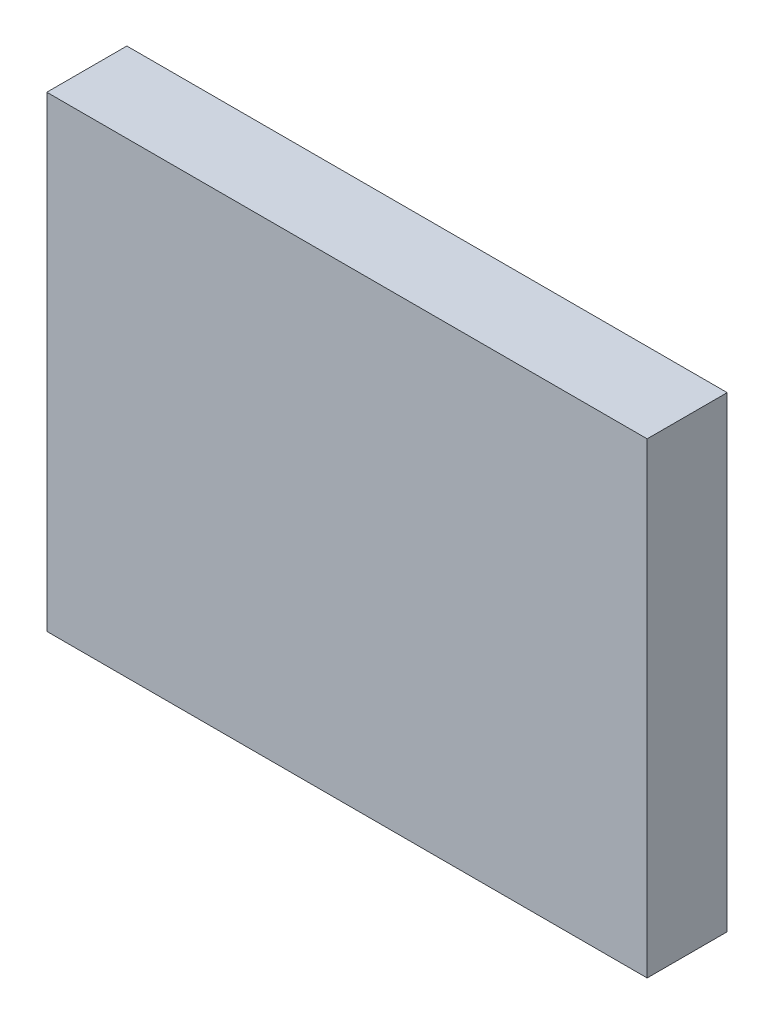
ISO-10303-21;
HEADER;
FILE_DESCRIPTION(('STEP AP214'),'2;1');
FILE_NAME('part.step','',(''),(''),'','','');
FILE_SCHEMA(('AUTOMOTIVE_DESIGN { 1 0 10303 214 1 1 1 1 }'));
ENDSEC;
DATA;
#1=APPLICATION_CONTEXT('core data for automotive mechanical design processes');
#2=APPLICATION_PROTOCOL_DEFINITION('international standard','automotive_design',2000,#1);
#3=PRODUCT_CONTEXT('',#1,'mechanical');
#4=PRODUCT('Part','Part','',(#3));
#5=PRODUCT_RELATED_PRODUCT_CATEGORY('part','',(#4));
#6=PRODUCT_DEFINITION_FORMATION('','',#4);
#7=PRODUCT_DEFINITION_CONTEXT('part definition',#1,'design');
#8=PRODUCT_DEFINITION('design','',#6,#7);
#9=PRODUCT_DEFINITION_SHAPE('','',#8);
#10=(LENGTH_UNIT() NAMED_UNIT(*) SI_UNIT(.MILLI.,.METRE.));
#11=(NAMED_UNIT(*) PLANE_ANGLE_UNIT() SI_UNIT($,.RADIAN.));
#12=(NAMED_UNIT(*) SI_UNIT($,.STERADIAN.) SOLID_ANGLE_UNIT());
#13=UNCERTAINTY_MEASURE_WITH_UNIT(LENGTH_MEASURE(1.E-05),#10,'distance_accuracy_value','');
#14=(GEOMETRIC_REPRESENTATION_CONTEXT(3) GLOBAL_UNCERTAINTY_ASSIGNED_CONTEXT((#13)) GLOBAL_UNIT_ASSIGNED_CONTEXT((#10,
#11,#12)) REPRESENTATION_CONTEXT('',''));
#15=CARTESIAN_POINT('',(0.,0.,0.));
#16=DIRECTION('',(0.,0.,1.));
#17=DIRECTION('',(1.,0.,0.));
#18=AXIS2_PLACEMENT_3D('',#15,#16,#17);
#19=CARTESIAN_POINT('',(4.5,-3.5,1.2));
#20=DIRECTION('',(-1.,0.,0.));
#21=DIRECTION('',(0.,0.,1.));
#22=AXIS2_PLACEMENT_3D('',#19,#20,#21);
#23=PLANE('',#22);
#24=DIRECTION('',(0.,1.,0.));
#25=VECTOR('',#24,1.);
#26=CARTESIAN_POINT('',(4.5,-3.5,0.));
#27=LINE('',#26,#25);
#28=CARTESIAN_POINT('',(4.5,-3.5,0.));
#29=VERTEX_POINT('',#28);
#30=CARTESIAN_POINT('',(4.5,3.5,0.));
#31=VERTEX_POINT('',#30);
#32=EDGE_CURVE('E11',#29,#31,#27,.T.);
#33=ORIENTED_EDGE('',*,*,#32,.T.);
#34=DIRECTION('',(0.,0.,-1.));
#35=VECTOR('',#34,1.);
#36=CARTESIAN_POINT('',(4.5,3.5,1.2));
#37=LINE('',#36,#35);
#38=CARTESIAN_POINT('',(4.5,3.5,1.2));
#39=VERTEX_POINT('',#38);
#40=EDGE_CURVE('E44',#39,#31,#37,.T.);
#41=ORIENTED_EDGE('',*,*,#40,.F.);
#42=DIRECTION('',(0.,1.,0.));
#43=VECTOR('',#42,1.);
#44=CARTESIAN_POINT('',(4.5,-3.5,1.2));
#45=LINE('',#44,#43);
#46=CARTESIAN_POINT('',(4.5,-3.5,1.2));
#47=VERTEX_POINT('',#46);
#48=EDGE_CURVE('E71',#47,#39,#45,.T.);
#49=ORIENTED_EDGE('',*,*,#48,.F.);
#50=DIRECTION('',(0.,0.,-1.));
#51=VECTOR('',#50,1.);
#52=CARTESIAN_POINT('',(4.5,-3.5,1.2));
#53=LINE('',#52,#51);
#54=EDGE_CURVE('E29',#47,#29,#53,.T.);
#55=ORIENTED_EDGE('',*,*,#54,.T.);
#56=EDGE_LOOP('',(#33,#41,#49,#55));
#57=FACE_BOUND('',#56,.T.);
#58=ADVANCED_FACE('F18',(#57),#23,.F.);
#59=CARTESIAN_POINT('',(4.5,3.5,1.2));
#60=DIRECTION('',(0.,-1.,0.));
#61=DIRECTION('',(0.,0.,-1.));
#62=AXIS2_PLACEMENT_3D('',#59,#60,#61);
#63=PLANE('',#62);
#64=DIRECTION('',(-1.,0.,0.));
#65=VECTOR('',#64,1.);
#66=CARTESIAN_POINT('',(4.5,3.5,0.));
#67=LINE('',#66,#65);
#68=CARTESIAN_POINT('',(-4.5,3.5,0.));
#69=VERTEX_POINT('',#68);
#70=EDGE_CURVE('E77',#31,#69,#67,.T.);
#71=ORIENTED_EDGE('',*,*,#70,.T.);
#72=DIRECTION('',(0.,0.,-1.));
#73=VECTOR('',#72,1.);
#74=CARTESIAN_POINT('',(-4.5,3.5,1.2));
#75=LINE('',#74,#73);
#76=CARTESIAN_POINT('',(-4.5,3.5,1.2));
#77=VERTEX_POINT('',#76);
#78=EDGE_CURVE('E86',#77,#69,#75,.T.);
#79=ORIENTED_EDGE('',*,*,#78,.F.);
#80=DIRECTION('',(-1.,0.,0.));
#81=VECTOR('',#80,1.);
#82=CARTESIAN_POINT('',(4.5,3.5,1.2));
#83=LINE('',#82,#81);
#84=EDGE_CURVE('E101',#39,#77,#83,.T.);
#85=ORIENTED_EDGE('',*,*,#84,.F.);
#86=ORIENTED_EDGE('',*,*,#40,.T.);
#87=EDGE_LOOP('',(#71,#79,#85,#86));
#88=FACE_BOUND('',#87,.T.);
#89=ADVANCED_FACE('F116',(#88),#63,.F.);
#90=CARTESIAN_POINT('',(-4.5,3.5,1.2));
#91=DIRECTION('',(1.,0.,0.));
#92=DIRECTION('',(0.,1.,0.));
#93=AXIS2_PLACEMENT_3D('',#90,#91,#92);
#94=PLANE('',#93);
#95=DIRECTION('',(0.,-1.,0.));
#96=VECTOR('',#95,1.);
#97=CARTESIAN_POINT('',(-4.5,3.5,0.));
#98=LINE('',#97,#96);
#99=CARTESIAN_POINT('',(-4.5,-3.5,0.));
#100=VERTEX_POINT('',#99);
#101=EDGE_CURVE('E93',#69,#100,#98,.T.);
#102=ORIENTED_EDGE('',*,*,#101,.T.);
#103=DIRECTION('',(0.,0.,-1.));
#104=VECTOR('',#103,1.);
#105=CARTESIAN_POINT('',(-4.5,-3.5,1.2));
#106=LINE('',#105,#104);
#107=CARTESIAN_POINT('',(-4.5,-3.5,1.2));
#108=VERTEX_POINT('',#107);
#109=EDGE_CURVE('E22',#108,#100,#106,.T.);
#110=ORIENTED_EDGE('',*,*,#109,.F.);
#111=DIRECTION('',(0.,-1.,0.));
#112=VECTOR('',#111,1.);
#113=CARTESIAN_POINT('',(-4.5,3.5,1.2));
#114=LINE('',#113,#112);
#115=EDGE_CURVE('E97',#77,#108,#114,.T.);
#116=ORIENTED_EDGE('',*,*,#115,.F.);
#117=ORIENTED_EDGE('',*,*,#78,.T.);
#118=EDGE_LOOP('',(#102,#110,#116,#117));
#119=FACE_BOUND('',#118,.T.);
#120=ADVANCED_FACE('F113',(#119),#94,.F.);
#121=CARTESIAN_POINT('',(-4.5,-3.5,1.2));
#122=DIRECTION('',(0.,1.,0.));
#123=DIRECTION('',(1.,0.,0.));
#124=AXIS2_PLACEMENT_3D('',#121,#122,#123);
#125=PLANE('',#124);
#126=DIRECTION('',(1.,0.,0.));
#127=VECTOR('',#126,1.);
#128=CARTESIAN_POINT('',(-4.5,-3.5,0.));
#129=LINE('',#128,#127);
#130=EDGE_CURVE('E82',#100,#29,#129,.T.);
#131=ORIENTED_EDGE('',*,*,#130,.T.);
#132=ORIENTED_EDGE('',*,*,#54,.F.);
#133=DIRECTION('',(1.,0.,0.));
#134=VECTOR('',#133,1.);
#135=CARTESIAN_POINT('',(-4.5,-3.5,1.2));
#136=LINE('',#135,#134);
#137=EDGE_CURVE('E102',#108,#47,#136,.T.);
#138=ORIENTED_EDGE('',*,*,#137,.F.);
#139=ORIENTED_EDGE('',*,*,#109,.T.);
#140=EDGE_LOOP('',(#131,#132,#138,#139));
#141=FACE_BOUND('',#140,.T.);
#142=ADVANCED_FACE('F20',(#141),#125,.F.);
#143=CARTESIAN_POINT('',(0.,0.,1.2));
#144=DIRECTION('',(0.,0.,1.));
#145=DIRECTION('',(1.,0.,0.));
#146=AXIS2_PLACEMENT_3D('',#143,#144,#145);
#147=PLANE('',#146);
#148=ORIENTED_EDGE('',*,*,#48,.T.);
#149=ORIENTED_EDGE('',*,*,#84,.T.);
#150=ORIENTED_EDGE('',*,*,#115,.T.);
#151=ORIENTED_EDGE('',*,*,#137,.T.);
#152=EDGE_LOOP('',(#148,#149,#150,#151));
#153=FACE_BOUND('',#152,.T.);
#154=ADVANCED_FACE('F126',(#153),#147,.T.);
#155=CARTESIAN_POINT('',(0.,0.,0.));
#156=DIRECTION('',(0.,0.,1.));
#157=DIRECTION('',(1.,0.,0.));
#158=AXIS2_PLACEMENT_3D('',#155,#156,#157);
#159=PLANE('',#158);
#160=ORIENTED_EDGE('',*,*,#32,.F.);
#161=ORIENTED_EDGE('',*,*,#130,.F.);
#162=ORIENTED_EDGE('',*,*,#101,.F.);
#163=ORIENTED_EDGE('',*,*,#70,.F.);
#164=EDGE_LOOP('',(#160,#161,#162,#163));
#165=FACE_BOUND('',#164,.T.);
#166=ADVANCED_FACE('F80',(#165),#159,.F.);
#167=CLOSED_SHELL('',(#58,#89,#120,#142,#154,#166));
#168=MANIFOLD_SOLID_BREP('B1',#167);
#169=ADVANCED_BREP_SHAPE_REPRESENTATION('',(#18,#168),#14);
#170=SHAPE_DEFINITION_REPRESENTATION(#9,#169);
ENDSEC;
END-ISO-10303-21;
